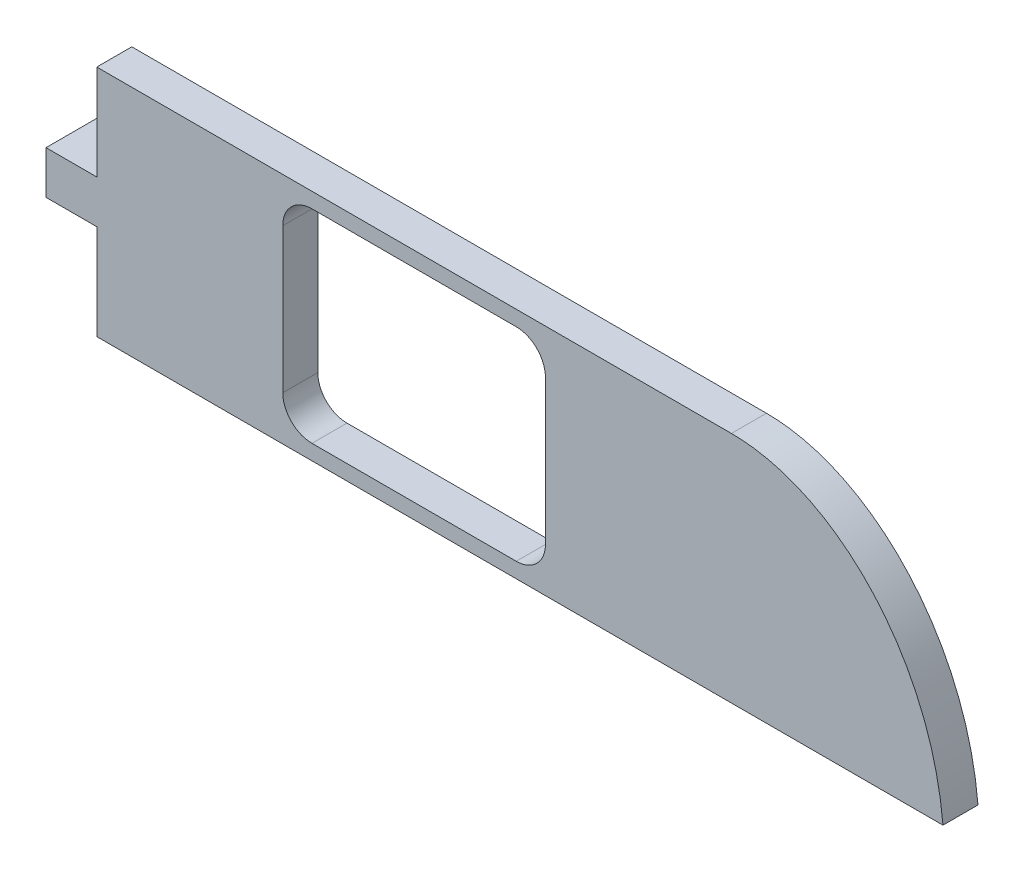
ISO-10303-21;
HEADER;
FILE_DESCRIPTION(('STEP AP214'),'2;1');
FILE_NAME('part.step','',(''),(''),'','','');
FILE_SCHEMA(('AUTOMOTIVE_DESIGN { 1 0 10303 214 1 1 1 1 }'));
ENDSEC;
DATA;
#1=APPLICATION_CONTEXT('core data for automotive mechanical design processes');
#2=APPLICATION_PROTOCOL_DEFINITION('international standard','automotive_design',2000,#1);
#3=PRODUCT_CONTEXT('',#1,'mechanical');
#4=PRODUCT('Part','Part','',(#3));
#5=PRODUCT_RELATED_PRODUCT_CATEGORY('part','',(#4));
#6=PRODUCT_DEFINITION_FORMATION('','',#4);
#7=PRODUCT_DEFINITION_CONTEXT('part definition',#1,'design');
#8=PRODUCT_DEFINITION('design','',#6,#7);
#9=PRODUCT_DEFINITION_SHAPE('','',#8);
#10=(LENGTH_UNIT() NAMED_UNIT(*) SI_UNIT(.MILLI.,.METRE.));
#11=(NAMED_UNIT(*) PLANE_ANGLE_UNIT() SI_UNIT($,.RADIAN.));
#12=(NAMED_UNIT(*) SI_UNIT($,.STERADIAN.) SOLID_ANGLE_UNIT());
#13=UNCERTAINTY_MEASURE_WITH_UNIT(LENGTH_MEASURE(1.E-05),#10,'distance_accuracy_value','');
#14=(GEOMETRIC_REPRESENTATION_CONTEXT(3) GLOBAL_UNCERTAINTY_ASSIGNED_CONTEXT((#13)) GLOBAL_UNIT_ASSIGNED_CONTEXT((#10,
#11,#12)) REPRESENTATION_CONTEXT('',''));
#15=CARTESIAN_POINT('',(0.,0.,0.));
#16=DIRECTION('',(0.,0.,1.));
#17=DIRECTION('',(1.,0.,0.));
#18=AXIS2_PLACEMENT_3D('',#15,#16,#17);
#19=CARTESIAN_POINT('',(-67.1923444786349,-27.5297553517312,0.));
#20=DIRECTION('',(0.,0.,1.));
#21=DIRECTION('',(1.,0.,0.));
#22=AXIS2_PLACEMENT_3D('',#19,#20,#21);
#23=PLANE('',#22);
#24=DIRECTION('',(-1.,0.,0.));
#25=VECTOR('',#24,1.);
#26=CARTESIAN_POINT('',(-72.7724491248261,-26.6697154161693,0.));
#27=LINE('',#26,#25);
#28=CARTESIAN_POINT('',(-73.2724491248261,-26.6697154161693,0.));
#29=VERTEX_POINT('',#28);
#30=CARTESIAN_POINT('',(-76.7724491248261,-26.6697154161693,0.));
#31=VERTEX_POINT('',#30);
#32=EDGE_CURVE('E219',#29,#31,#27,.T.);
#33=ORIENTED_EDGE('',*,*,#32,.T.);
#34=CARTESIAN_POINT('',(-76.7724491248261,-27.1697154161693,0.));
#35=DIRECTION('',(0.,0.,1.));
#36=DIRECTION('',(1.,0.,0.));
#37=AXIS2_PLACEMENT_3D('',#34,#35,#36);
#38=CIRCLE('',#37,0.5);
#39=CARTESIAN_POINT('',(-77.2724491248261,-27.1697154161693,0.));
#40=VERTEX_POINT('',#39);
#41=EDGE_CURVE('E473',#31,#40,#38,.T.);
#42=ORIENTED_EDGE('',*,*,#41,.T.);
#43=DIRECTION('',(0.,-1.,0.));
#44=VECTOR('',#43,1.);
#45=CARTESIAN_POINT('',(-77.2724491248261,-26.6697154161693,0.));
#46=LINE('',#45,#44);
#47=CARTESIAN_POINT('',(-77.2724491248261,-29.6489358557344,0.));
#48=VERTEX_POINT('',#47);
#49=EDGE_CURVE('E203',#40,#48,#46,.T.);
#50=ORIENTED_EDGE('',*,*,#49,.T.);
#51=CARTESIAN_POINT('',(-76.7724491248261,-29.6489358557344,0.));
#52=DIRECTION('',(0.,0.,1.));
#53=DIRECTION('',(1.,0.,0.));
#54=AXIS2_PLACEMENT_3D('',#51,#52,#53);
#55=CIRCLE('',#54,0.5);
#56=CARTESIAN_POINT('',(-76.7724491248261,-30.1489358557344,0.));
#57=VERTEX_POINT('',#56);
#58=EDGE_CURVE('E42',#48,#57,#55,.T.);
#59=ORIENTED_EDGE('',*,*,#58,.T.);
#60=DIRECTION('',(1.,0.,0.));
#61=VECTOR('',#60,1.);
#62=CARTESIAN_POINT('',(-72.7724491248261,-30.1489358557344,0.));
#63=LINE('',#62,#61);
#64=CARTESIAN_POINT('',(-73.2724491248261,-30.1489358557344,0.));
#65=VERTEX_POINT('',#64);
#66=EDGE_CURVE('E206',#57,#65,#63,.T.);
#67=ORIENTED_EDGE('',*,*,#66,.T.);
#68=CARTESIAN_POINT('',(-73.2724491248261,-29.6489358557344,0.));
#69=DIRECTION('',(0.,0.,1.));
#70=DIRECTION('',(1.,0.,0.));
#71=AXIS2_PLACEMENT_3D('',#68,#69,#70);
#72=CIRCLE('',#71,0.5);
#73=CARTESIAN_POINT('',(-72.7724491248261,-29.6489358557344,0.));
#74=VERTEX_POINT('',#73);
#75=EDGE_CURVE('E481',#65,#74,#72,.T.);
#76=ORIENTED_EDGE('',*,*,#75,.T.);
#77=DIRECTION('',(0.,1.,0.));
#78=VECTOR('',#77,1.);
#79=CARTESIAN_POINT('',(-72.7724491248261,-26.6697154161693,0.));
#80=LINE('',#79,#78);
#81=CARTESIAN_POINT('',(-72.7724491248261,-27.1697154161693,0.));
#82=VERTEX_POINT('',#81);
#83=EDGE_CURVE('E211',#74,#82,#80,.T.);
#84=ORIENTED_EDGE('',*,*,#83,.T.);
#85=CARTESIAN_POINT('',(-73.2724491248261,-27.1697154161693,0.));
#86=DIRECTION('',(0.,0.,1.));
#87=DIRECTION('',(1.,0.,0.));
#88=AXIS2_PLACEMENT_3D('',#85,#86,#87);
#89=CIRCLE('',#88,0.5);
#90=EDGE_CURVE('E477',#82,#29,#89,.T.);
#91=ORIENTED_EDGE('',*,*,#90,.T.);
#92=EDGE_LOOP('',(#33,#42,#50,#59,#67,#76,#84,#91));
#93=FACE_BOUND('',#92,.T.);
#94=DIRECTION('',(0.,-1.,0.));
#95=VECTOR('',#94,1.);
#96=CARTESIAN_POINT('',(-81.0285361715379,-28.040210216998,0.));
#97=LINE('',#96,#95);
#98=CARTESIAN_POINT('',(-81.0285361715379,-28.040210216998,0.));
#99=VERTEX_POINT('',#98);
#100=CARTESIAN_POINT('',(-81.0285361715379,-28.7784410549057,0.));
#101=VERTEX_POINT('',#100);
#102=EDGE_CURVE('E50',#99,#101,#97,.T.);
#103=ORIENTED_EDGE('',*,*,#102,.F.);
#104=DIRECTION('',(-1.,0.,0.));
#105=VECTOR('',#104,1.);
#106=CARTESIAN_POINT('',(-80.4587310616466,-28.040210216998,0.));
#107=LINE('',#106,#105);
#108=CARTESIAN_POINT('',(-80.4587310616466,-28.040210216998,0.));
#109=VERTEX_POINT('',#108);
#110=EDGE_CURVE('E197',#109,#99,#107,.T.);
#111=ORIENTED_EDGE('',*,*,#110,.F.);
#112=DIRECTION('',(0.,-1.,0.));
#113=VECTOR('',#112,1.);
#114=CARTESIAN_POINT('',(-80.4587310616466,-26.4093256359519,0.));
#115=LINE('',#114,#113);
#116=CARTESIAN_POINT('',(-80.4587310616466,-26.4093256359519,0.));
#117=VERTEX_POINT('',#116);
#118=EDGE_CURVE('E457',#117,#109,#115,.T.);
#119=ORIENTED_EDGE('',*,*,#118,.F.);
#120=DIRECTION('',(-1.,0.,0.));
#121=VECTOR('',#120,1.);
#122=CARTESIAN_POINT('',(-80.4587310616466,-26.4093256359519,0.));
#123=LINE('',#122,#121);
#124=CARTESIAN_POINT('',(-69.5861671880056,-26.4093256359519,0.));
#125=VERTEX_POINT('',#124);
#126=EDGE_CURVE('E226',#125,#117,#123,.T.);
#127=ORIENTED_EDGE('',*,*,#126,.F.);
#128=CARTESIAN_POINT('',(-65.9618826000666,-30.4093256359519,0.));
#129=CARTESIAN_POINT('',(-66.1716018717304,-28.06380487803,0.));
#130=CARTESIAN_POINT('',(-67.8253001419386,-26.4093256359519,0.));
#131=CARTESIAN_POINT('',(-69.5861671880056,-26.4093256359519,0.));
#132=B_SPLINE_CURVE_WITH_KNOTS('',3,(#128,#129,#130,#131),.UNSPECIFIED.,.F.,.F.,(4,4),(0.,1.),.UNSPECIFIED.);
#133=CARTESIAN_POINT('',(-65.9618826000666,-30.4093256359519,0.));
#134=VERTEX_POINT('',#133);
#135=EDGE_CURVE('E453',#134,#125,#132,.T.);
#136=ORIENTED_EDGE('',*,*,#135,.F.);
#137=DIRECTION('',(1.,0.,0.));
#138=VECTOR('',#137,1.);
#139=CARTESIAN_POINT('',(-69.5861671880056,-30.4093256359519,0.));
#140=LINE('',#139,#138);
#141=CARTESIAN_POINT('',(-80.4587310616466,-30.4093256359519,0.));
#142=VERTEX_POINT('',#141);
#143=EDGE_CURVE('E517',#142,#134,#140,.T.);
#144=ORIENTED_EDGE('',*,*,#143,.F.);
#145=DIRECTION('',(0.,-1.,0.));
#146=VECTOR('',#145,1.);
#147=CARTESIAN_POINT('',(-80.4587310616466,-28.7784410549057,0.));
#148=LINE('',#147,#146);
#149=CARTESIAN_POINT('',(-80.4587310616466,-28.7784410549057,0.));
#150=VERTEX_POINT('',#149);
#151=EDGE_CURVE('E467',#150,#142,#148,.T.);
#152=ORIENTED_EDGE('',*,*,#151,.F.);
#153=DIRECTION('',(1.,0.,0.));
#154=VECTOR('',#153,1.);
#155=CARTESIAN_POINT('',(-81.3285361715379,-28.7784410549057,0.));
#156=LINE('',#155,#154);
#157=EDGE_CURVE('E460',#101,#150,#156,.T.);
#158=ORIENTED_EDGE('',*,*,#157,.F.);
#159=EDGE_LOOP('',(#103,#111,#119,#127,#136,#144,#152,#158));
#160=FACE_BOUND('',#159,.T.);
#161=ADVANCED_FACE('F33',(#93,#160),#23,.F.);
#162=CARTESIAN_POINT('',(-67.1923444786349,-27.5297553517312,0.6));
#163=DIRECTION('',(0.,0.,1.));
#164=DIRECTION('',(1.,0.,0.));
#165=AXIS2_PLACEMENT_3D('',#162,#163,#164);
#166=PLANE('',#165);
#167=DIRECTION('',(0.,-1.,0.));
#168=VECTOR('',#167,1.);
#169=CARTESIAN_POINT('',(-80.4587310616466,-26.4093256359519,0.6));
#170=LINE('',#169,#168);
#171=CARTESIAN_POINT('',(-80.4587310616466,-26.4093256359519,0.6));
#172=VERTEX_POINT('',#171);
#173=CARTESIAN_POINT('',(-80.4587310616466,-28.040210216998,0.6));
#174=VERTEX_POINT('',#173);
#175=EDGE_CURVE('E222',#172,#174,#170,.T.);
#176=ORIENTED_EDGE('',*,*,#175,.T.);
#177=DIRECTION('',(-1.,0.,0.));
#178=VECTOR('',#177,1.);
#179=CARTESIAN_POINT('',(-80.4587310616466,-28.040210216998,0.6));
#180=LINE('',#179,#178);
#181=CARTESIAN_POINT('',(-81.3285361715379,-28.040210216998,0.6));
#182=VERTEX_POINT('',#181);
#183=EDGE_CURVE('E225',#174,#182,#180,.T.);
#184=ORIENTED_EDGE('',*,*,#183,.T.);
#185=DIRECTION('',(0.,-1.,0.));
#186=VECTOR('',#185,1.);
#187=CARTESIAN_POINT('',(-81.3285361715379,-28.040210216998,0.6));
#188=LINE('',#187,#186);
#189=CARTESIAN_POINT('',(-81.3285361715379,-28.7784410549057,0.6));
#190=VERTEX_POINT('',#189);
#191=EDGE_CURVE('E167',#182,#190,#188,.T.);
#192=ORIENTED_EDGE('',*,*,#191,.T.);
#193=DIRECTION('',(1.,0.,0.));
#194=VECTOR('',#193,1.);
#195=CARTESIAN_POINT('',(-81.3285361715379,-28.7784410549057,0.6));
#196=LINE('',#195,#194);
#197=CARTESIAN_POINT('',(-80.4587310616466,-28.7784410549057,0.6));
#198=VERTEX_POINT('',#197);
#199=EDGE_CURVE('E229',#190,#198,#196,.T.);
#200=ORIENTED_EDGE('',*,*,#199,.T.);
#201=DIRECTION('',(0.,-1.,0.));
#202=VECTOR('',#201,1.);
#203=CARTESIAN_POINT('',(-80.4587310616466,-28.7784410549057,0.6));
#204=LINE('',#203,#202);
#205=CARTESIAN_POINT('',(-80.4587310616466,-30.4093256359519,0.6));
#206=VERTEX_POINT('',#205);
#207=EDGE_CURVE('E231',#198,#206,#204,.T.);
#208=ORIENTED_EDGE('',*,*,#207,.T.);
#209=DIRECTION('',(1.,0.,0.));
#210=VECTOR('',#209,1.);
#211=CARTESIAN_POINT('',(-69.5861671880056,-30.4093256359519,0.6));
#212=LINE('',#211,#210);
#213=CARTESIAN_POINT('',(-65.9618826000666,-30.4093256359519,0.6));
#214=VERTEX_POINT('',#213);
#215=EDGE_CURVE('E233',#206,#214,#212,.T.);
#216=ORIENTED_EDGE('',*,*,#215,.T.);
#217=CARTESIAN_POINT('',(-65.9618826000666,-30.4093256359519,0.6));
#218=CARTESIAN_POINT('',(-66.1716018717304,-28.06380487803,0.6));
#219=CARTESIAN_POINT('',(-67.8253001419386,-26.4093256359519,0.6));
#220=CARTESIAN_POINT('',(-69.5861671880056,-26.4093256359519,0.6));
#221=B_SPLINE_CURVE_WITH_KNOTS('',3,(#217,#218,#219,#220),.UNSPECIFIED.,.F.,.F.,(4,4),(0.,1.),.UNSPECIFIED.);
#222=CARTESIAN_POINT('',(-69.5861671880056,-26.4093256359519,0.6));
#223=VERTEX_POINT('',#222);
#224=EDGE_CURVE('E235',#214,#223,#221,.T.);
#225=ORIENTED_EDGE('',*,*,#224,.T.);
#226=DIRECTION('',(-1.,0.,0.));
#227=VECTOR('',#226,1.);
#228=CARTESIAN_POINT('',(-80.4587310616466,-26.4093256359519,0.6));
#229=LINE('',#228,#227);
#230=EDGE_CURVE('E240',#223,#172,#229,.T.);
#231=ORIENTED_EDGE('',*,*,#230,.T.);
#232=EDGE_LOOP('',(#176,#184,#192,#200,#208,#216,#225,#231));
#233=FACE_BOUND('',#232,.T.);
#234=DIRECTION('',(1.,0.,0.));
#235=VECTOR('',#234,1.);
#236=CARTESIAN_POINT('',(-72.7724491248261,-30.1489358557344,0.6));
#237=LINE('',#236,#235);
#238=CARTESIAN_POINT('',(-76.7724491248261,-30.1489358557344,0.6));
#239=VERTEX_POINT('',#238);
#240=CARTESIAN_POINT('',(-73.2724491248261,-30.1489358557344,0.6));
#241=VERTEX_POINT('',#240);
#242=EDGE_CURVE('E532',#239,#241,#237,.T.);
#243=ORIENTED_EDGE('',*,*,#242,.F.);
#244=CARTESIAN_POINT('',(-76.7724491248261,-29.6489358557344,0.6));
#245=DIRECTION('',(0.,0.,1.));
#246=DIRECTION('',(1.,0.,0.));
#247=AXIS2_PLACEMENT_3D('',#244,#245,#246);
#248=CIRCLE('',#247,0.5);
#249=CARTESIAN_POINT('',(-77.2724491248261,-29.6489358557344,0.6));
#250=VERTEX_POINT('',#249);
#251=EDGE_CURVE('E11',#239,#250,#248,.F.);
#252=ORIENTED_EDGE('',*,*,#251,.T.);
#253=DIRECTION('',(0.,-1.,0.));
#254=VECTOR('',#253,1.);
#255=CARTESIAN_POINT('',(-77.2724491248261,-26.6697154161693,0.6));
#256=LINE('',#255,#254);
#257=CARTESIAN_POINT('',(-77.2724491248261,-27.1697154161693,0.6));
#258=VERTEX_POINT('',#257);
#259=EDGE_CURVE('E193',#258,#250,#256,.T.);
#260=ORIENTED_EDGE('',*,*,#259,.F.);
#261=CARTESIAN_POINT('',(-76.7724491248261,-27.1697154161693,0.6));
#262=DIRECTION('',(0.,0.,1.));
#263=DIRECTION('',(1.,0.,0.));
#264=AXIS2_PLACEMENT_3D('',#261,#262,#263);
#265=CIRCLE('',#264,0.5);
#266=CARTESIAN_POINT('',(-76.7724491248261,-26.6697154161693,0.6));
#267=VERTEX_POINT('',#266);
#268=EDGE_CURVE('E471',#258,#267,#265,.F.);
#269=ORIENTED_EDGE('',*,*,#268,.T.);
#270=DIRECTION('',(-1.,0.,0.));
#271=VECTOR('',#270,1.);
#272=CARTESIAN_POINT('',(-72.7724491248261,-26.6697154161693,0.6));
#273=LINE('',#272,#271);
#274=CARTESIAN_POINT('',(-73.2724491248261,-26.6697154161693,0.6));
#275=VERTEX_POINT('',#274);
#276=EDGE_CURVE('E214',#275,#267,#273,.T.);
#277=ORIENTED_EDGE('',*,*,#276,.F.);
#278=CARTESIAN_POINT('',(-73.2724491248261,-27.1697154161693,0.6));
#279=DIRECTION('',(0.,0.,1.));
#280=DIRECTION('',(1.,0.,0.));
#281=AXIS2_PLACEMENT_3D('',#278,#279,#280);
#282=CIRCLE('',#281,0.5);
#283=CARTESIAN_POINT('',(-72.7724491248261,-27.1697154161693,0.6));
#284=VERTEX_POINT('',#283);
#285=EDGE_CURVE('E475',#275,#284,#282,.F.);
#286=ORIENTED_EDGE('',*,*,#285,.T.);
#287=DIRECTION('',(0.,1.,0.));
#288=VECTOR('',#287,1.);
#289=CARTESIAN_POINT('',(-72.7724491248261,-26.6697154161693,0.6));
#290=LINE('',#289,#288);
#291=CARTESIAN_POINT('',(-72.7724491248261,-29.6489358557344,0.6));
#292=VERTEX_POINT('',#291);
#293=EDGE_CURVE('E462',#292,#284,#290,.T.);
#294=ORIENTED_EDGE('',*,*,#293,.F.);
#295=CARTESIAN_POINT('',(-73.2724491248261,-29.6489358557344,0.6));
#296=DIRECTION('',(0.,0.,1.));
#297=DIRECTION('',(1.,0.,0.));
#298=AXIS2_PLACEMENT_3D('',#295,#296,#297);
#299=CIRCLE('',#298,0.5);
#300=EDGE_CURVE('E479',#292,#241,#299,.F.);
#301=ORIENTED_EDGE('',*,*,#300,.T.);
#302=EDGE_LOOP('',(#243,#252,#260,#269,#277,#286,#294,#301));
#303=FACE_BOUND('',#302,.T.);
#304=ADVANCED_FACE('F272',(#233,#303),#166,.T.);
#305=CARTESIAN_POINT('',(-80.4587310616466,-26.4093256359519,0.6));
#306=DIRECTION('',(1.,0.,0.));
#307=DIRECTION('',(0.,1.,0.));
#308=AXIS2_PLACEMENT_3D('',#305,#306,#307);
#309=PLANE('',#308);
#310=ORIENTED_EDGE('',*,*,#118,.T.);
#311=DIRECTION('',(0.,0.,-1.));
#312=VECTOR('',#311,1.);
#313=CARTESIAN_POINT('',(-80.4587310616466,-28.040210216998,0.6));
#314=LINE('',#313,#312);
#315=EDGE_CURVE('E169',#174,#109,#314,.T.);
#316=ORIENTED_EDGE('',*,*,#315,.F.);
#317=ORIENTED_EDGE('',*,*,#175,.F.);
#318=DIRECTION('',(0.,0.,-1.));
#319=VECTOR('',#318,1.);
#320=CARTESIAN_POINT('',(-80.4587310616466,-26.4093256359519,0.6));
#321=LINE('',#320,#319);
#322=EDGE_CURVE('E447',#172,#117,#321,.T.);
#323=ORIENTED_EDGE('',*,*,#322,.T.);
#324=EDGE_LOOP('',(#310,#316,#317,#323));
#325=FACE_BOUND('',#324,.T.);
#326=ADVANCED_FACE('F269',(#325),#309,.F.);
#327=CARTESIAN_POINT('',(-80.4587310616466,-28.040210216998,0.6));
#328=DIRECTION('',(0.,-1.,0.));
#329=DIRECTION('',(1.,0.,0.));
#330=AXIS2_PLACEMENT_3D('',#327,#328,#329);
#331=PLANE('',#330);
#332=ORIENTED_EDGE('',*,*,#110,.T.);
#333=DIRECTION('',(0.,0.,1.));
#334=VECTOR('',#333,1.);
#335=CARTESIAN_POINT('',(-81.0285361715379,-28.040210216998,-0.8));
#336=LINE('',#335,#334);
#337=CARTESIAN_POINT('',(-81.0285361715379,-28.040210216998,-0.8));
#338=VERTEX_POINT('',#337);
#339=EDGE_CURVE('E176',#338,#99,#336,.T.);
#340=ORIENTED_EDGE('',*,*,#339,.F.);
#341=DIRECTION('',(1.,0.,0.));
#342=VECTOR('',#341,1.);
#343=CARTESIAN_POINT('',(-81.3285361715379,-28.040210216998,-0.8));
#344=LINE('',#343,#342);
#345=CARTESIAN_POINT('',(-81.3285361715379,-28.040210216998,-0.8));
#346=VERTEX_POINT('',#345);
#347=EDGE_CURVE('E173',#346,#338,#344,.T.);
#348=ORIENTED_EDGE('',*,*,#347,.F.);
#349=DIRECTION('',(0.,0.,-1.));
#350=VECTOR('',#349,1.);
#351=CARTESIAN_POINT('',(-81.3285361715379,-28.040210216998,0.6));
#352=LINE('',#351,#350);
#353=EDGE_CURVE('E161',#182,#346,#352,.T.);
#354=ORIENTED_EDGE('',*,*,#353,.F.);
#355=ORIENTED_EDGE('',*,*,#183,.F.);
#356=ORIENTED_EDGE('',*,*,#315,.T.);
#357=EDGE_LOOP('',(#332,#340,#348,#354,#355,#356));
#358=FACE_BOUND('',#357,.T.);
#359=ADVANCED_FACE('F174',(#358),#331,.F.);
#360=CARTESIAN_POINT('',(-81.3285361715379,-28.040210216998,0.6));
#361=DIRECTION('',(1.,0.,0.));
#362=DIRECTION('',(0.,0.,-1.));
#363=AXIS2_PLACEMENT_3D('',#360,#361,#362);
#364=PLANE('',#363);
#365=ORIENTED_EDGE('',*,*,#353,.T.);
#366=DIRECTION('',(0.,1.,0.));
#367=VECTOR('',#366,1.);
#368=CARTESIAN_POINT('',(-81.3285361715379,-28.7784410549057,-0.8));
#369=LINE('',#368,#367);
#370=CARTESIAN_POINT('',(-81.3285361715379,-28.7784410549057,-0.8));
#371=VERTEX_POINT('',#370);
#372=EDGE_CURVE('E166',#371,#346,#369,.T.);
#373=ORIENTED_EDGE('',*,*,#372,.F.);
#374=DIRECTION('',(0.,0.,-1.));
#375=VECTOR('',#374,1.);
#376=CARTESIAN_POINT('',(-81.3285361715379,-28.7784410549057,0.6));
#377=LINE('',#376,#375);
#378=EDGE_CURVE('E170',#190,#371,#377,.T.);
#379=ORIENTED_EDGE('',*,*,#378,.F.);
#380=ORIENTED_EDGE('',*,*,#191,.F.);
#381=EDGE_LOOP('',(#365,#373,#379,#380));
#382=FACE_BOUND('',#381,.T.);
#383=ADVANCED_FACE('F163',(#382),#364,.F.);
#384=CARTESIAN_POINT('',(-81.3285361715379,-28.7784410549057,0.6));
#385=DIRECTION('',(0.,1.,0.));
#386=DIRECTION('',(0.,0.,1.));
#387=AXIS2_PLACEMENT_3D('',#384,#385,#386);
#388=PLANE('',#387);
#389=ORIENTED_EDGE('',*,*,#378,.T.);
#390=DIRECTION('',(-1.,0.,0.));
#391=VECTOR('',#390,1.);
#392=CARTESIAN_POINT('',(-81.0285361715379,-28.7784410549057,-0.8));
#393=LINE('',#392,#391);
#394=CARTESIAN_POINT('',(-81.0285361715379,-28.7784410549057,-0.8));
#395=VERTEX_POINT('',#394);
#396=EDGE_CURVE('E184',#395,#371,#393,.T.);
#397=ORIENTED_EDGE('',*,*,#396,.F.);
#398=DIRECTION('',(0.,0.,1.));
#399=VECTOR('',#398,1.);
#400=CARTESIAN_POINT('',(-81.0285361715379,-28.7784410549057,-0.8));
#401=LINE('',#400,#399);
#402=EDGE_CURVE('E190',#395,#101,#401,.T.);
#403=ORIENTED_EDGE('',*,*,#402,.T.);
#404=ORIENTED_EDGE('',*,*,#157,.T.);
#405=DIRECTION('',(0.,0.,-1.));
#406=VECTOR('',#405,1.);
#407=CARTESIAN_POINT('',(-80.4587310616466,-28.7784410549057,0.6));
#408=LINE('',#407,#406);
#409=EDGE_CURVE('E505',#198,#150,#408,.T.);
#410=ORIENTED_EDGE('',*,*,#409,.F.);
#411=ORIENTED_EDGE('',*,*,#199,.F.);
#412=EDGE_LOOP('',(#389,#397,#403,#404,#410,#411));
#413=FACE_BOUND('',#412,.T.);
#414=ADVANCED_FACE('F260',(#413),#388,.F.);
#415=CARTESIAN_POINT('',(-80.4587310616466,-28.7784410549057,0.6));
#416=DIRECTION('',(1.,0.,0.));
#417=DIRECTION('',(0.,0.,-1.));
#418=AXIS2_PLACEMENT_3D('',#415,#416,#417);
#419=PLANE('',#418);
#420=ORIENTED_EDGE('',*,*,#151,.T.);
#421=DIRECTION('',(0.,0.,-1.));
#422=VECTOR('',#421,1.);
#423=CARTESIAN_POINT('',(-80.4587310616466,-30.4093256359519,0.6));
#424=LINE('',#423,#422);
#425=EDGE_CURVE('E508',#206,#142,#424,.T.);
#426=ORIENTED_EDGE('',*,*,#425,.F.);
#427=ORIENTED_EDGE('',*,*,#207,.F.);
#428=ORIENTED_EDGE('',*,*,#409,.T.);
#429=EDGE_LOOP('',(#420,#426,#427,#428));
#430=FACE_BOUND('',#429,.T.);
#431=ADVANCED_FACE('F256',(#430),#419,.F.);
#432=CARTESIAN_POINT('',(-69.5861671880056,-30.4093256359519,0.6));
#433=DIRECTION('',(0.,1.,0.));
#434=DIRECTION('',(0.,0.,1.));
#435=AXIS2_PLACEMENT_3D('',#432,#433,#434);
#436=PLANE('',#435);
#437=ORIENTED_EDGE('',*,*,#143,.T.);
#438=DIRECTION('',(0.,0.,-1.));
#439=VECTOR('',#438,1.);
#440=CARTESIAN_POINT('',(-65.9618826000666,-30.4093256359519,0.6));
#441=LINE('',#440,#439);
#442=EDGE_CURVE('E511',#214,#134,#441,.T.);
#443=ORIENTED_EDGE('',*,*,#442,.F.);
#444=ORIENTED_EDGE('',*,*,#215,.F.);
#445=ORIENTED_EDGE('',*,*,#425,.T.);
#446=EDGE_LOOP('',(#437,#443,#444,#445));
#447=FACE_BOUND('',#446,.T.);
#448=ADVANCED_FACE('F251',(#447),#436,.F.);
#449=DIRECTION('',(0.,0.,-1.));
#450=VECTOR('',#449,1.);
#451=SURFACE_OF_LINEAR_EXTRUSION('',#221,#450);
#452=ORIENTED_EDGE('',*,*,#135,.T.);
#453=DIRECTION('',(0.,0.,-1.));
#454=VECTOR('',#453,1.);
#455=CARTESIAN_POINT('',(-69.5861671880056,-26.4093256359519,0.6));
#456=LINE('',#455,#454);
#457=EDGE_CURVE('E450',#223,#125,#456,.T.);
#458=ORIENTED_EDGE('',*,*,#457,.F.);
#459=ORIENTED_EDGE('',*,*,#224,.F.);
#460=ORIENTED_EDGE('',*,*,#442,.T.);
#461=EDGE_LOOP('',(#452,#458,#459,#460));
#462=FACE_BOUND('',#461,.T.);
#463=ADVANCED_FACE('F246',(#462),#451,.F.);
#464=CARTESIAN_POINT('',(-80.4587310616466,-26.4093256359519,0.6));
#465=DIRECTION('',(0.,-1.,0.));
#466=DIRECTION('',(0.,0.,-1.));
#467=AXIS2_PLACEMENT_3D('',#464,#465,#466);
#468=PLANE('',#467);
#469=ORIENTED_EDGE('',*,*,#126,.T.);
#470=ORIENTED_EDGE('',*,*,#322,.F.);
#471=ORIENTED_EDGE('',*,*,#230,.F.);
#472=ORIENTED_EDGE('',*,*,#457,.T.);
#473=EDGE_LOOP('',(#469,#470,#471,#472));
#474=FACE_BOUND('',#473,.T.);
#475=ADVANCED_FACE('F250',(#474),#468,.F.);
#476=CARTESIAN_POINT('',(-77.2724491248261,-26.6697154161693,0.6));
#477=DIRECTION('',(1.,0.,0.));
#478=DIRECTION('',(0.,0.,-1.));
#479=AXIS2_PLACEMENT_3D('',#476,#477,#478);
#480=PLANE('',#479);
#481=ORIENTED_EDGE('',*,*,#49,.F.);
#482=DIRECTION('',(0.,0.,-1.));
#483=VECTOR('',#482,1.);
#484=CARTESIAN_POINT('',(-77.2724491248261,-27.1697154161693,0.6));
#485=LINE('',#484,#483);
#486=EDGE_CURVE('E483',#40,#258,#485,.F.);
#487=ORIENTED_EDGE('',*,*,#486,.T.);
#488=ORIENTED_EDGE('',*,*,#259,.T.);
#489=DIRECTION('',(0.,0.,-1.));
#490=VECTOR('',#489,1.);
#491=CARTESIAN_POINT('',(-77.2724491248261,-29.6489358557344,0.));
#492=LINE('',#491,#490);
#493=EDGE_CURVE('E485',#250,#48,#492,.T.);
#494=ORIENTED_EDGE('',*,*,#493,.T.);
#495=EDGE_LOOP('',(#481,#487,#488,#494));
#496=FACE_BOUND('',#495,.T.);
#497=ADVANCED_FACE('F298',(#496),#480,.T.);
#498=CARTESIAN_POINT('',(-72.7724491248261,-30.1489358557344,0.6));
#499=DIRECTION('',(0.,1.,0.));
#500=DIRECTION('',(0.,0.,1.));
#501=AXIS2_PLACEMENT_3D('',#498,#499,#500);
#502=PLANE('',#501);
#503=ORIENTED_EDGE('',*,*,#242,.T.);
#504=DIRECTION('',(0.,0.,-1.));
#505=VECTOR('',#504,1.);
#506=CARTESIAN_POINT('',(-73.2724491248261,-30.1489358557344,0.));
#507=LINE('',#506,#505);
#508=EDGE_CURVE('E498',#241,#65,#507,.T.);
#509=ORIENTED_EDGE('',*,*,#508,.T.);
#510=ORIENTED_EDGE('',*,*,#66,.F.);
#511=DIRECTION('',(0.,0.,-1.));
#512=VECTOR('',#511,1.);
#513=CARTESIAN_POINT('',(-76.7724491248261,-30.1489358557344,0.6));
#514=LINE('',#513,#512);
#515=EDGE_CURVE('E501',#57,#239,#514,.F.);
#516=ORIENTED_EDGE('',*,*,#515,.T.);
#517=EDGE_LOOP('',(#503,#509,#510,#516));
#518=FACE_BOUND('',#517,.T.);
#519=ADVANCED_FACE('F301',(#518),#502,.T.);
#520=CARTESIAN_POINT('',(-72.7724491248261,-26.6697154161693,0.6));
#521=DIRECTION('',(-1.,0.,0.));
#522=DIRECTION('',(0.,0.,1.));
#523=AXIS2_PLACEMENT_3D('',#520,#521,#522);
#524=PLANE('',#523);
#525=ORIENTED_EDGE('',*,*,#83,.F.);
#526=DIRECTION('',(0.,0.,-1.));
#527=VECTOR('',#526,1.);
#528=CARTESIAN_POINT('',(-72.7724491248261,-29.6489358557344,0.6));
#529=LINE('',#528,#527);
#530=EDGE_CURVE('E493',#74,#292,#529,.F.);
#531=ORIENTED_EDGE('',*,*,#530,.T.);
#532=ORIENTED_EDGE('',*,*,#293,.T.);
#533=DIRECTION('',(0.,0.,-1.));
#534=VECTOR('',#533,1.);
#535=CARTESIAN_POINT('',(-72.7724491248261,-27.1697154161693,0.));
#536=LINE('',#535,#534);
#537=EDGE_CURVE('E495',#284,#82,#536,.T.);
#538=ORIENTED_EDGE('',*,*,#537,.T.);
#539=EDGE_LOOP('',(#525,#531,#532,#538));
#540=FACE_BOUND('',#539,.T.);
#541=ADVANCED_FACE('F305',(#540),#524,.T.);
#542=CARTESIAN_POINT('',(-72.7724491248261,-26.6697154161693,0.6));
#543=DIRECTION('',(0.,-1.,0.));
#544=DIRECTION('',(0.,0.,-1.));
#545=AXIS2_PLACEMENT_3D('',#542,#543,#544);
#546=PLANE('',#545);
#547=ORIENTED_EDGE('',*,*,#32,.F.);
#548=DIRECTION('',(0.,0.,-1.));
#549=VECTOR('',#548,1.);
#550=CARTESIAN_POINT('',(-73.2724491248261,-26.6697154161693,0.6));
#551=LINE('',#550,#549);
#552=EDGE_CURVE('E488',#29,#275,#551,.F.);
#553=ORIENTED_EDGE('',*,*,#552,.T.);
#554=ORIENTED_EDGE('',*,*,#276,.T.);
#555=DIRECTION('',(0.,0.,-1.));
#556=VECTOR('',#555,1.);
#557=CARTESIAN_POINT('',(-76.7724491248261,-26.6697154161693,0.));
#558=LINE('',#557,#556);
#559=EDGE_CURVE('E490',#267,#31,#558,.T.);
#560=ORIENTED_EDGE('',*,*,#559,.T.);
#561=EDGE_LOOP('',(#547,#553,#554,#560));
#562=FACE_BOUND('',#561,.T.);
#563=ADVANCED_FACE('F278',(#562),#546,.T.);
#564=CARTESIAN_POINT('',(-73.2724491248261,-29.6489358557344,0.6));
#565=DIRECTION('',(0.,0.,1.));
#566=DIRECTION('',(1.,0.,0.));
#567=AXIS2_PLACEMENT_3D('',#564,#565,#566);
#568=CYLINDRICAL_SURFACE('',#567,0.5);
#569=ORIENTED_EDGE('',*,*,#300,.F.);
#570=ORIENTED_EDGE('',*,*,#530,.F.);
#571=ORIENTED_EDGE('',*,*,#75,.F.);
#572=ORIENTED_EDGE('',*,*,#508,.F.);
#573=EDGE_LOOP('',(#569,#570,#571,#572));
#574=FACE_BOUND('',#573,.T.);
#575=ADVANCED_FACE('F274',(#574),#568,.F.);
#576=CARTESIAN_POINT('',(-73.2724491248261,-27.1697154161693,0.6));
#577=DIRECTION('',(0.,0.,1.));
#578=DIRECTION('',(1.,0.,0.));
#579=AXIS2_PLACEMENT_3D('',#576,#577,#578);
#580=CYLINDRICAL_SURFACE('',#579,0.5);
#581=ORIENTED_EDGE('',*,*,#285,.F.);
#582=ORIENTED_EDGE('',*,*,#552,.F.);
#583=ORIENTED_EDGE('',*,*,#90,.F.);
#584=ORIENTED_EDGE('',*,*,#537,.F.);
#585=EDGE_LOOP('',(#581,#582,#583,#584));
#586=FACE_BOUND('',#585,.T.);
#587=ADVANCED_FACE('F277',(#586),#580,.F.);
#588=CARTESIAN_POINT('',(-76.7724491248261,-27.1697154161693,0.6));
#589=DIRECTION('',(0.,0.,1.));
#590=DIRECTION('',(1.,0.,0.));
#591=AXIS2_PLACEMENT_3D('',#588,#589,#590);
#592=CYLINDRICAL_SURFACE('',#591,0.5);
#593=ORIENTED_EDGE('',*,*,#268,.F.);
#594=ORIENTED_EDGE('',*,*,#486,.F.);
#595=ORIENTED_EDGE('',*,*,#41,.F.);
#596=ORIENTED_EDGE('',*,*,#559,.F.);
#597=EDGE_LOOP('',(#593,#594,#595,#596));
#598=FACE_BOUND('',#597,.T.);
#599=ADVANCED_FACE('F281',(#598),#592,.F.);
#600=CARTESIAN_POINT('',(-76.7724491248261,-29.6489358557344,0.6));
#601=DIRECTION('',(0.,0.,1.));
#602=DIRECTION('',(1.,0.,0.));
#603=AXIS2_PLACEMENT_3D('',#600,#601,#602);
#604=CYLINDRICAL_SURFACE('',#603,0.5);
#605=ORIENTED_EDGE('',*,*,#251,.F.);
#606=ORIENTED_EDGE('',*,*,#515,.F.);
#607=ORIENTED_EDGE('',*,*,#58,.F.);
#608=ORIENTED_EDGE('',*,*,#493,.F.);
#609=EDGE_LOOP('',(#605,#606,#607,#608));
#610=FACE_BOUND('',#609,.T.);
#611=ADVANCED_FACE('F35',(#610),#604,.F.);
#612=CARTESIAN_POINT('',(-81.0285361715379,-28.040210216998,-0.8));
#613=DIRECTION('',(-1.,0.,0.));
#614=DIRECTION('',(0.,0.,1.));
#615=AXIS2_PLACEMENT_3D('',#612,#613,#614);
#616=PLANE('',#615);
#617=ORIENTED_EDGE('',*,*,#102,.T.);
#618=ORIENTED_EDGE('',*,*,#402,.F.);
#619=DIRECTION('',(0.,-1.,0.));
#620=VECTOR('',#619,1.);
#621=CARTESIAN_POINT('',(-81.0285361715379,-28.040210216998,-0.8));
#622=LINE('',#621,#620);
#623=EDGE_CURVE('E179',#338,#395,#622,.T.);
#624=ORIENTED_EDGE('',*,*,#623,.F.);
#625=ORIENTED_EDGE('',*,*,#339,.T.);
#626=EDGE_LOOP('',(#617,#618,#624,#625));
#627=FACE_BOUND('',#626,.T.);
#628=ADVANCED_FACE('F288',(#627),#616,.F.);
#629=CARTESIAN_POINT('',(0.,0.,-0.8));
#630=DIRECTION('',(0.,0.,-1.));
#631=DIRECTION('',(-1.,0.,0.));
#632=AXIS2_PLACEMENT_3D('',#629,#630,#631);
#633=PLANE('',#632);
#634=ORIENTED_EDGE('',*,*,#372,.T.);
#635=ORIENTED_EDGE('',*,*,#347,.T.);
#636=ORIENTED_EDGE('',*,*,#623,.T.);
#637=ORIENTED_EDGE('',*,*,#396,.T.);
#638=EDGE_LOOP('',(#634,#635,#636,#637));
#639=FACE_BOUND('',#638,.T.);
#640=ADVANCED_FACE('F182',(#639),#633,.T.);
#641=CLOSED_SHELL('',(#161,#304,#326,#359,#383,#414,#431,#448,#463,#475,#497,#519,#541,#563,
#575,#587,#599,#611,#628,#640));
#642=MANIFOLD_SOLID_BREP('B2',#641);
#643=ADVANCED_BREP_SHAPE_REPRESENTATION('',(#18,#642),#14);
#644=SHAPE_DEFINITION_REPRESENTATION(#9,#643);
ENDSEC;
END-ISO-10303-21;
